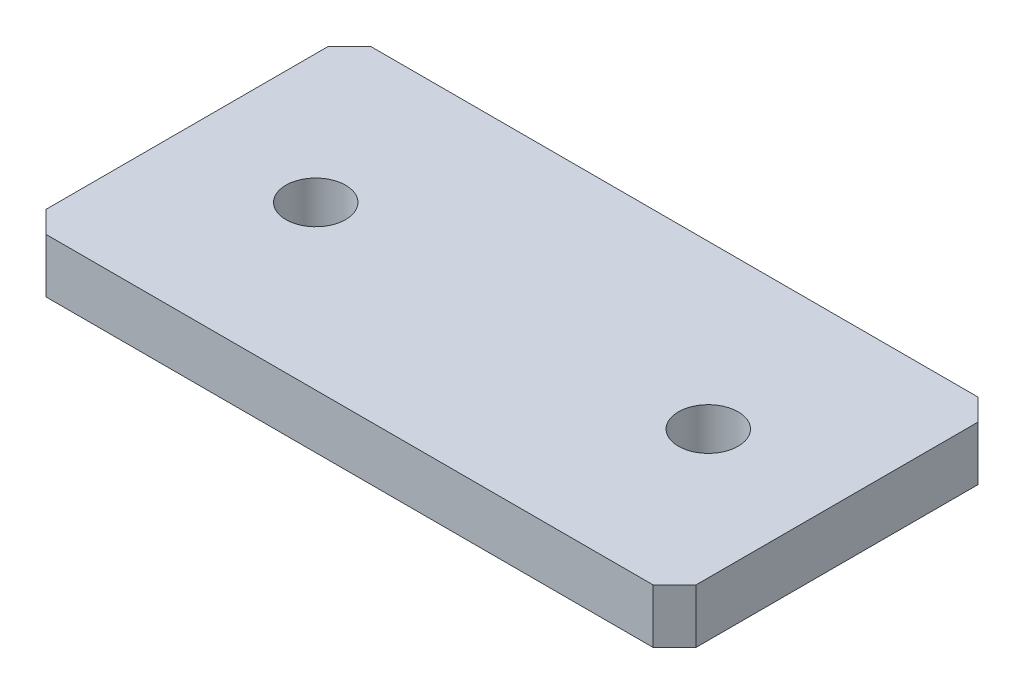
ISO-10303-21;
HEADER;
FILE_DESCRIPTION(('STEP AP214'),'2;1');
FILE_NAME('part.step','',(''),(''),'','','');
FILE_SCHEMA(('AUTOMOTIVE_DESIGN { 1 0 10303 214 1 1 1 1 }'));
ENDSEC;
DATA;
#1=APPLICATION_CONTEXT('core data for automotive mechanical design processes');
#2=APPLICATION_PROTOCOL_DEFINITION('international standard','automotive_design',2000,#1);
#3=PRODUCT_CONTEXT('',#1,'mechanical');
#4=PRODUCT('Part','Part','',(#3));
#5=PRODUCT_RELATED_PRODUCT_CATEGORY('part','',(#4));
#6=PRODUCT_DEFINITION_FORMATION('','',#4);
#7=PRODUCT_DEFINITION_CONTEXT('part definition',#1,'design');
#8=PRODUCT_DEFINITION('design','',#6,#7);
#9=PRODUCT_DEFINITION_SHAPE('','',#8);
#10=(LENGTH_UNIT() NAMED_UNIT(*) SI_UNIT(.MILLI.,.METRE.));
#11=(NAMED_UNIT(*) PLANE_ANGLE_UNIT() SI_UNIT($,.RADIAN.));
#12=(NAMED_UNIT(*) SI_UNIT($,.STERADIAN.) SOLID_ANGLE_UNIT());
#13=UNCERTAINTY_MEASURE_WITH_UNIT(LENGTH_MEASURE(1.E-05),#10,'distance_accuracy_value','');
#14=(GEOMETRIC_REPRESENTATION_CONTEXT(3) GLOBAL_UNCERTAINTY_ASSIGNED_CONTEXT((#13)) GLOBAL_UNIT_ASSIGNED_CONTEXT((#10,
#11,#12)) REPRESENTATION_CONTEXT('',''));
#15=CARTESIAN_POINT('',(0.,0.,0.));
#16=DIRECTION('',(0.,0.,1.));
#17=DIRECTION('',(1.,0.,0.));
#18=AXIS2_PLACEMENT_3D('',#15,#16,#17);
#19=CARTESIAN_POINT('',(38.1,6.35,-19.05));
#20=DIRECTION('',(-1.,0.,0.));
#21=DIRECTION('',(0.,0.,1.));
#22=AXIS2_PLACEMENT_3D('',#19,#20,#21);
#23=PLANE('',#22);
#24=DIRECTION('',(0.,0.,-1.));
#25=VECTOR('',#24,1.);
#26=CARTESIAN_POINT('',(38.1,0.,-19.05));
#27=LINE('',#26,#25);
#28=CARTESIAN_POINT('',(38.1,0.,16.51));
#29=VERTEX_POINT('',#28);
#30=CARTESIAN_POINT('',(38.1,0.,-16.51));
#31=VERTEX_POINT('',#30);
#32=EDGE_CURVE('E141',#29,#31,#27,.T.);
#33=ORIENTED_EDGE('',*,*,#32,.T.);
#34=DIRECTION('',(0.,1.,0.));
#35=VECTOR('',#34,1.);
#36=CARTESIAN_POINT('',(38.1,6.35,-16.51));
#37=LINE('',#36,#35);
#38=CARTESIAN_POINT('',(38.1,6.35,-16.51));
#39=VERTEX_POINT('',#38);
#40=EDGE_CURVE('E164',#31,#39,#37,.T.);
#41=ORIENTED_EDGE('',*,*,#40,.T.);
#42=DIRECTION('',(0.,0.,-1.));
#43=VECTOR('',#42,1.);
#44=CARTESIAN_POINT('',(38.1,6.35,-19.05));
#45=LINE('',#44,#43);
#46=CARTESIAN_POINT('',(38.1,6.35,16.51));
#47=VERTEX_POINT('',#46);
#48=EDGE_CURVE('E139',#47,#39,#45,.T.);
#49=ORIENTED_EDGE('',*,*,#48,.F.);
#50=DIRECTION('',(0.,-1.,0.));
#51=VECTOR('',#50,1.);
#52=CARTESIAN_POINT('',(38.1,6.35,16.51));
#53=LINE('',#52,#51);
#54=EDGE_CURVE('E161',#47,#29,#53,.T.);
#55=ORIENTED_EDGE('',*,*,#54,.T.);
#56=EDGE_LOOP('',(#33,#41,#49,#55));
#57=FACE_BOUND('',#56,.T.);
#58=ADVANCED_FACE('F45',(#57),#23,.F.);
#59=CARTESIAN_POINT('',(-38.1,6.35,-19.05));
#60=DIRECTION('',(0.,0.,1.));
#61=DIRECTION('',(1.,0.,0.));
#62=AXIS2_PLACEMENT_3D('',#59,#60,#61);
#63=PLANE('',#62);
#64=DIRECTION('',(-1.,0.,0.));
#65=VECTOR('',#64,1.);
#66=CARTESIAN_POINT('',(-38.1,0.,-19.05));
#67=LINE('',#66,#65);
#68=CARTESIAN_POINT('',(35.56,0.,-19.05));
#69=VERTEX_POINT('',#68);
#70=CARTESIAN_POINT('',(-35.56,0.,-19.05));
#71=VERTEX_POINT('',#70);
#72=EDGE_CURVE('E137',#69,#71,#67,.T.);
#73=ORIENTED_EDGE('',*,*,#72,.T.);
#74=DIRECTION('',(0.,1.,0.));
#75=VECTOR('',#74,1.);
#76=CARTESIAN_POINT('',(-35.56,6.35,-19.05));
#77=LINE('',#76,#75);
#78=CARTESIAN_POINT('',(-35.56,6.35,-19.05));
#79=VERTEX_POINT('',#78);
#80=EDGE_CURVE('E116',#71,#79,#77,.T.);
#81=ORIENTED_EDGE('',*,*,#80,.T.);
#82=DIRECTION('',(-1.,0.,0.));
#83=VECTOR('',#82,1.);
#84=CARTESIAN_POINT('',(-38.1,6.35,-19.05));
#85=LINE('',#84,#83);
#86=CARTESIAN_POINT('',(35.56,6.35,-19.05));
#87=VERTEX_POINT('',#86);
#88=EDGE_CURVE('E180',#87,#79,#85,.T.);
#89=ORIENTED_EDGE('',*,*,#88,.F.);
#90=DIRECTION('',(0.,-1.,0.));
#91=VECTOR('',#90,1.);
#92=CARTESIAN_POINT('',(35.56,6.35,-19.05));
#93=LINE('',#92,#91);
#94=EDGE_CURVE('E121',#87,#69,#93,.T.);
#95=ORIENTED_EDGE('',*,*,#94,.T.);
#96=EDGE_LOOP('',(#73,#81,#89,#95));
#97=FACE_BOUND('',#96,.T.);
#98=ADVANCED_FACE('F213',(#97),#63,.F.);
#99=CARTESIAN_POINT('',(-38.1,6.35,-19.05));
#100=DIRECTION('',(1.,0.,0.));
#101=DIRECTION('',(0.,0.,-1.));
#102=AXIS2_PLACEMENT_3D('',#99,#100,#101);
#103=PLANE('',#102);
#104=DIRECTION('',(0.,0.,1.));
#105=VECTOR('',#104,1.);
#106=CARTESIAN_POINT('',(-38.1,6.35,-19.05));
#107=LINE('',#106,#105);
#108=CARTESIAN_POINT('',(-38.1,6.35,-16.51));
#109=VERTEX_POINT('',#108);
#110=CARTESIAN_POINT('',(-38.1,6.35,16.51));
#111=VERTEX_POINT('',#110);
#112=EDGE_CURVE('E130',#109,#111,#107,.T.);
#113=ORIENTED_EDGE('',*,*,#112,.F.);
#114=DIRECTION('',(0.,-1.,0.));
#115=VECTOR('',#114,1.);
#116=CARTESIAN_POINT('',(-38.1,6.35,-16.51));
#117=LINE('',#116,#115);
#118=CARTESIAN_POINT('',(-38.1,0.,-16.51));
#119=VERTEX_POINT('',#118);
#120=EDGE_CURVE('E115',#109,#119,#117,.T.);
#121=ORIENTED_EDGE('',*,*,#120,.T.);
#122=DIRECTION('',(0.,0.,1.));
#123=VECTOR('',#122,1.);
#124=CARTESIAN_POINT('',(-38.1,0.,-19.05));
#125=LINE('',#124,#123);
#126=CARTESIAN_POINT('',(-38.1,0.,16.51));
#127=VERTEX_POINT('',#126);
#128=EDGE_CURVE('E128',#119,#127,#125,.T.);
#129=ORIENTED_EDGE('',*,*,#128,.T.);
#130=DIRECTION('',(0.,1.,0.));
#131=VECTOR('',#130,1.);
#132=CARTESIAN_POINT('',(-38.1,6.35,16.51));
#133=LINE('',#132,#131);
#134=EDGE_CURVE('E132',#127,#111,#133,.T.);
#135=ORIENTED_EDGE('',*,*,#134,.T.);
#136=EDGE_LOOP('',(#113,#121,#129,#135));
#137=FACE_BOUND('',#136,.T.);
#138=ADVANCED_FACE('F127',(#137),#103,.F.);
#139=CARTESIAN_POINT('',(-38.1,6.35,19.05));
#140=DIRECTION('',(0.,0.,-1.));
#141=DIRECTION('',(-1.,0.,0.));
#142=AXIS2_PLACEMENT_3D('',#139,#140,#141);
#143=PLANE('',#142);
#144=DIRECTION('',(1.,0.,0.));
#145=VECTOR('',#144,1.);
#146=CARTESIAN_POINT('',(-38.1,0.,19.05));
#147=LINE('',#146,#145);
#148=CARTESIAN_POINT('',(-35.56,0.,19.05));
#149=VERTEX_POINT('',#148);
#150=CARTESIAN_POINT('',(35.56,0.,19.05));
#151=VERTEX_POINT('',#150);
#152=EDGE_CURVE('E136',#149,#151,#147,.T.);
#153=ORIENTED_EDGE('',*,*,#152,.T.);
#154=DIRECTION('',(0.,1.,0.));
#155=VECTOR('',#154,1.);
#156=CARTESIAN_POINT('',(35.56,6.35,19.05));
#157=LINE('',#156,#155);
#158=CARTESIAN_POINT('',(35.56,6.35,19.05));
#159=VERTEX_POINT('',#158);
#160=EDGE_CURVE('E11',#151,#159,#157,.T.);
#161=ORIENTED_EDGE('',*,*,#160,.T.);
#162=DIRECTION('',(1.,0.,0.));
#163=VECTOR('',#162,1.);
#164=CARTESIAN_POINT('',(-38.1,6.35,19.05));
#165=LINE('',#164,#163);
#166=CARTESIAN_POINT('',(-35.56,6.35,19.05));
#167=VERTEX_POINT('',#166);
#168=EDGE_CURVE('E145',#167,#159,#165,.T.);
#169=ORIENTED_EDGE('',*,*,#168,.F.);
#170=DIRECTION('',(0.,-1.,0.));
#171=VECTOR('',#170,1.);
#172=CARTESIAN_POINT('',(-35.56,6.35,19.05));
#173=LINE('',#172,#171);
#174=EDGE_CURVE('E54',#167,#149,#173,.T.);
#175=ORIENTED_EDGE('',*,*,#174,.T.);
#176=EDGE_LOOP('',(#153,#161,#169,#175));
#177=FACE_BOUND('',#176,.T.);
#178=ADVANCED_FACE('F167',(#177),#143,.F.);
#179=CARTESIAN_POINT('',(0.,6.35,0.));
#180=DIRECTION('',(0.,1.,0.));
#181=DIRECTION('',(0.,0.,1.));
#182=AXIS2_PLACEMENT_3D('',#179,#180,#181);
#183=PLANE('',#182);
#184=CARTESIAN_POINT('',(-22.999999974,6.35,0.));
#185=DIRECTION('',(0.,1.,0.));
#186=DIRECTION('',(0.,0.,1.));
#187=AXIS2_PLACEMENT_3D('',#184,#185,#186);
#188=CIRCLE('',#187,3.5);
#189=CARTESIAN_POINT('',(-22.999999974,6.35,3.5));
#190=VERTEX_POINT('',#189);
#191=EDGE_CURVE('E198',#190,#190,#188,.T.);
#192=ORIENTED_EDGE('',*,*,#191,.F.);
#193=EDGE_LOOP('',(#192));
#194=FACE_BOUND('',#193,.T.);
#195=CARTESIAN_POINT('',(22.999999974,6.35,0.));
#196=DIRECTION('',(0.,1.,0.));
#197=DIRECTION('',(0.,0.,1.));
#198=AXIS2_PLACEMENT_3D('',#195,#196,#197);
#199=CIRCLE('',#198,3.5);
#200=CARTESIAN_POINT('',(22.999999974,6.35,3.5));
#201=VERTEX_POINT('',#200);
#202=EDGE_CURVE('E190',#201,#201,#199,.T.);
#203=ORIENTED_EDGE('',*,*,#202,.F.);
#204=EDGE_LOOP('',(#203));
#205=FACE_BOUND('',#204,.T.);
#206=ORIENTED_EDGE('',*,*,#88,.T.);
#207=DIRECTION('',(0.707106781186548,0.,-0.707106781186548));
#208=VECTOR('',#207,1.);
#209=CARTESIAN_POINT('',(-27.305,6.35,-27.305));
#210=LINE('',#209,#208);
#211=EDGE_CURVE('E159',#79,#109,#210,.F.);
#212=ORIENTED_EDGE('',*,*,#211,.T.);
#213=ORIENTED_EDGE('',*,*,#112,.T.);
#214=DIRECTION('',(-0.707106781186547,0.,-0.707106781186549));
#215=VECTOR('',#214,1.);
#216=CARTESIAN_POINT('',(-27.3050000000001,6.35,27.305));
#217=LINE('',#216,#215);
#218=EDGE_CURVE('E66',#111,#167,#217,.F.);
#219=ORIENTED_EDGE('',*,*,#218,.T.);
#220=ORIENTED_EDGE('',*,*,#168,.T.);
#221=DIRECTION('',(-0.707106781186547,0.,0.707106781186548));
#222=VECTOR('',#221,1.);
#223=CARTESIAN_POINT('',(27.3050000000001,6.35,27.305));
#224=LINE('',#223,#222);
#225=EDGE_CURVE('E155',#159,#47,#224,.F.);
#226=ORIENTED_EDGE('',*,*,#225,.T.);
#227=ORIENTED_EDGE('',*,*,#48,.T.);
#228=DIRECTION('',(0.707106781186546,0.,0.70710678118655));
#229=VECTOR('',#228,1.);
#230=CARTESIAN_POINT('',(27.3050000000001,6.35,-27.3049999999999));
#231=LINE('',#230,#229);
#232=EDGE_CURVE('E157',#39,#87,#231,.F.);
#233=ORIENTED_EDGE('',*,*,#232,.T.);
#234=EDGE_LOOP('',(#206,#212,#213,#219,#220,#226,#227,#233));
#235=FACE_BOUND('',#234,.T.);
#236=ADVANCED_FACE('F206',(#194,#205,#235),#183,.T.);
#237=CARTESIAN_POINT('',(0.,0.,0.));
#238=DIRECTION('',(0.,1.,0.));
#239=DIRECTION('',(0.,0.,1.));
#240=AXIS2_PLACEMENT_3D('',#237,#238,#239);
#241=PLANE('',#240);
#242=CARTESIAN_POINT('',(-22.999999974,0.,0.));
#243=DIRECTION('',(0.,1.,0.));
#244=DIRECTION('',(0.,0.,1.));
#245=AXIS2_PLACEMENT_3D('',#242,#243,#244);
#246=CIRCLE('',#245,3.5);
#247=CARTESIAN_POINT('',(-22.999999974,0.,3.5));
#248=VERTEX_POINT('',#247);
#249=EDGE_CURVE('E194',#248,#248,#246,.T.);
#250=ORIENTED_EDGE('',*,*,#249,.T.);
#251=EDGE_LOOP('',(#250));
#252=FACE_BOUND('',#251,.T.);
#253=CARTESIAN_POINT('',(22.999999974,0.,0.));
#254=DIRECTION('',(0.,1.,0.));
#255=DIRECTION('',(0.,0.,1.));
#256=AXIS2_PLACEMENT_3D('',#253,#254,#255);
#257=CIRCLE('',#256,3.5);
#258=CARTESIAN_POINT('',(22.999999974,0.,3.5));
#259=VERTEX_POINT('',#258);
#260=EDGE_CURVE('E185',#259,#259,#257,.T.);
#261=ORIENTED_EDGE('',*,*,#260,.T.);
#262=EDGE_LOOP('',(#261));
#263=FACE_BOUND('',#262,.T.);
#264=ORIENTED_EDGE('',*,*,#128,.F.);
#265=DIRECTION('',(-0.707106781186548,0.,0.707106781186548));
#266=VECTOR('',#265,1.);
#267=CARTESIAN_POINT('',(-38.1,0.,-16.51));
#268=LINE('',#267,#266);
#269=EDGE_CURVE('E111',#119,#71,#268,.F.);
#270=ORIENTED_EDGE('',*,*,#269,.T.);
#271=ORIENTED_EDGE('',*,*,#72,.F.);
#272=DIRECTION('',(-0.707106781186546,0.,-0.70710678118655));
#273=VECTOR('',#272,1.);
#274=CARTESIAN_POINT('',(35.56,0.,-19.05));
#275=LINE('',#274,#273);
#276=EDGE_CURVE('E122',#69,#31,#275,.F.);
#277=ORIENTED_EDGE('',*,*,#276,.T.);
#278=ORIENTED_EDGE('',*,*,#32,.F.);
#279=DIRECTION('',(0.707106781186547,0.,-0.707106781186548));
#280=VECTOR('',#279,1.);
#281=CARTESIAN_POINT('',(38.1,0.,16.51));
#282=LINE('',#281,#280);
#283=EDGE_CURVE('E148',#29,#151,#282,.F.);
#284=ORIENTED_EDGE('',*,*,#283,.T.);
#285=ORIENTED_EDGE('',*,*,#152,.F.);
#286=DIRECTION('',(0.707106781186547,0.,0.707106781186549));
#287=VECTOR('',#286,1.);
#288=CARTESIAN_POINT('',(-35.56,0.,19.05));
#289=LINE('',#288,#287);
#290=EDGE_CURVE('E131',#149,#127,#289,.F.);
#291=ORIENTED_EDGE('',*,*,#290,.T.);
#292=EDGE_LOOP('',(#264,#270,#271,#277,#278,#284,#285,#291));
#293=FACE_BOUND('',#292,.T.);
#294=ADVANCED_FACE('F134',(#252,#263,#293),#241,.F.);
#295=CARTESIAN_POINT('',(22.999999974,6.35,0.));
#296=DIRECTION('',(0.,1.,0.));
#297=DIRECTION('',(0.,0.,1.));
#298=AXIS2_PLACEMENT_3D('',#295,#296,#297);
#299=CYLINDRICAL_SURFACE('',#298,3.5);
#300=ORIENTED_EDGE('',*,*,#260,.F.);
#301=EDGE_LOOP('',(#300));
#302=FACE_BOUND('',#301,.T.);
#303=ORIENTED_EDGE('',*,*,#202,.T.);
#304=EDGE_LOOP('',(#303));
#305=FACE_BOUND('',#304,.T.);
#306=ADVANCED_FACE('F246',(#302,#305),#299,.F.);
#307=CARTESIAN_POINT('',(-22.999999974,6.35,0.));
#308=DIRECTION('',(0.,1.,0.));
#309=DIRECTION('',(0.,0.,1.));
#310=AXIS2_PLACEMENT_3D('',#307,#308,#309);
#311=CYLINDRICAL_SURFACE('',#310,3.5);
#312=ORIENTED_EDGE('',*,*,#249,.F.);
#313=EDGE_LOOP('',(#312));
#314=FACE_BOUND('',#313,.T.);
#315=ORIENTED_EDGE('',*,*,#191,.T.);
#316=EDGE_LOOP('',(#315));
#317=FACE_BOUND('',#316,.T.);
#318=ADVANCED_FACE('F204',(#314,#317),#311,.F.);
#319=CARTESIAN_POINT('',(-38.1,6.35,-16.51));
#320=DIRECTION('',(0.707106781186547,0.,0.707106781186547));
#321=DIRECTION('',(0.,-1.,0.));
#322=AXIS2_PLACEMENT_3D('',#319,#320,#321);
#323=PLANE('',#322);
#324=ORIENTED_EDGE('',*,*,#211,.F.);
#325=ORIENTED_EDGE('',*,*,#80,.F.);
#326=ORIENTED_EDGE('',*,*,#269,.F.);
#327=ORIENTED_EDGE('',*,*,#120,.F.);
#328=EDGE_LOOP('',(#324,#325,#326,#327));
#329=FACE_BOUND('',#328,.T.);
#330=ADVANCED_FACE('F114',(#329),#323,.F.);
#331=CARTESIAN_POINT('',(35.56,6.35,-19.05));
#332=DIRECTION('',(-0.70710678118655,0.,0.707106781186546));
#333=DIRECTION('',(0.,-1.,0.));
#334=AXIS2_PLACEMENT_3D('',#331,#332,#333);
#335=PLANE('',#334);
#336=ORIENTED_EDGE('',*,*,#232,.F.);
#337=ORIENTED_EDGE('',*,*,#40,.F.);
#338=ORIENTED_EDGE('',*,*,#276,.F.);
#339=ORIENTED_EDGE('',*,*,#94,.F.);
#340=EDGE_LOOP('',(#336,#337,#338,#339));
#341=FACE_BOUND('',#340,.T.);
#342=ADVANCED_FACE('F215',(#341),#335,.F.);
#343=CARTESIAN_POINT('',(38.1,6.35,16.51));
#344=DIRECTION('',(-0.707106781186548,0.,-0.707106781186547));
#345=DIRECTION('',(0.,-1.,0.));
#346=AXIS2_PLACEMENT_3D('',#343,#344,#345);
#347=PLANE('',#346);
#348=ORIENTED_EDGE('',*,*,#225,.F.);
#349=ORIENTED_EDGE('',*,*,#160,.F.);
#350=ORIENTED_EDGE('',*,*,#283,.F.);
#351=ORIENTED_EDGE('',*,*,#54,.F.);
#352=EDGE_LOOP('',(#348,#349,#350,#351));
#353=FACE_BOUND('',#352,.T.);
#354=ADVANCED_FACE('F174',(#353),#347,.F.);
#355=CARTESIAN_POINT('',(-35.56,6.35,19.05));
#356=DIRECTION('',(0.707106781186548,0.,-0.707106781186546));
#357=DIRECTION('',(0.,-1.,0.));
#358=AXIS2_PLACEMENT_3D('',#355,#356,#357);
#359=PLANE('',#358);
#360=ORIENTED_EDGE('',*,*,#218,.F.);
#361=ORIENTED_EDGE('',*,*,#134,.F.);
#362=ORIENTED_EDGE('',*,*,#290,.F.);
#363=ORIENTED_EDGE('',*,*,#174,.F.);
#364=EDGE_LOOP('',(#360,#361,#362,#363));
#365=FACE_BOUND('',#364,.T.);
#366=ADVANCED_FACE('F48',(#365),#359,.F.);
#367=CLOSED_SHELL('',(#58,#98,#138,#178,#236,#294,#306,#318,#330,#342,#354,#366));
#368=MANIFOLD_SOLID_BREP('B2',#367);
#369=ADVANCED_BREP_SHAPE_REPRESENTATION('',(#18,#368),#14);
#370=SHAPE_DEFINITION_REPRESENTATION(#9,#369);
ENDSEC;
END-ISO-10303-21;
